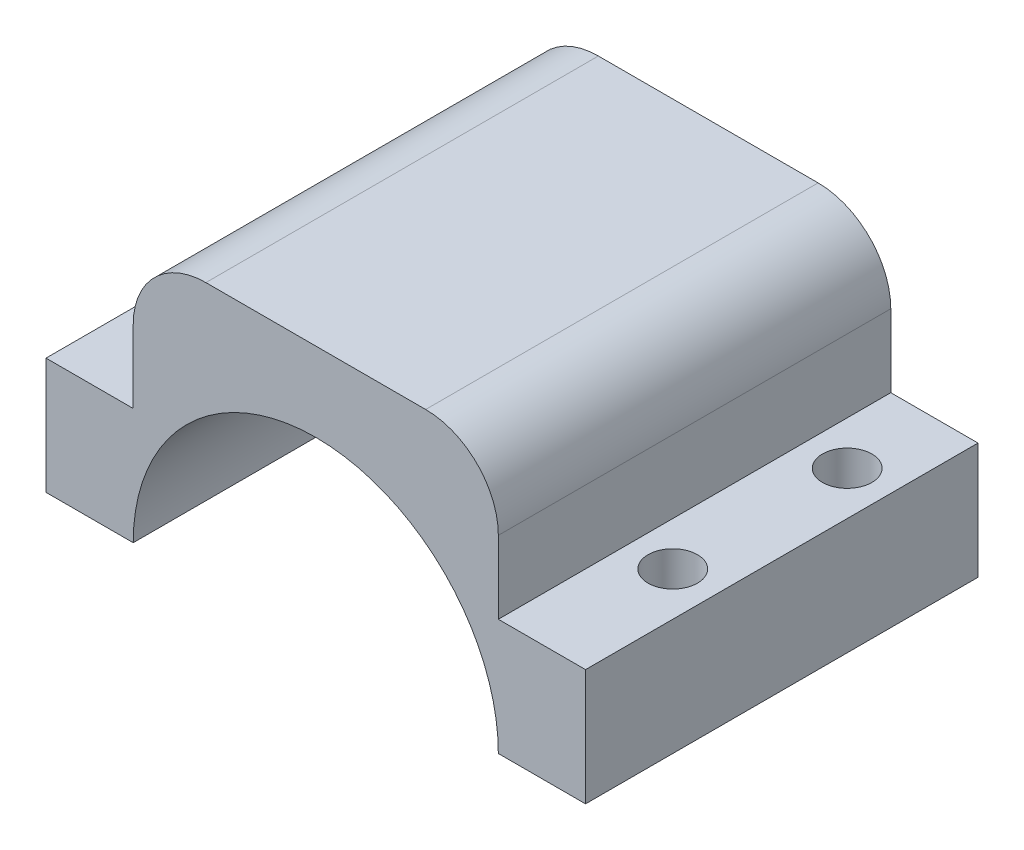
ISO-10303-21;
HEADER;
FILE_DESCRIPTION(('STEP AP214'),'2;1');
FILE_NAME('part.step','',(''),(''),'','','');
FILE_SCHEMA(('AUTOMOTIVE_DESIGN { 1 0 10303 214 1 1 1 1 }'));
ENDSEC;
DATA;
#1=APPLICATION_CONTEXT('core data for automotive mechanical design processes');
#2=APPLICATION_PROTOCOL_DEFINITION('international standard','automotive_design',2000,#1);
#3=PRODUCT_CONTEXT('',#1,'mechanical');
#4=PRODUCT('Part','Part','',(#3));
#5=PRODUCT_RELATED_PRODUCT_CATEGORY('part','',(#4));
#6=PRODUCT_DEFINITION_FORMATION('','',#4);
#7=PRODUCT_DEFINITION_CONTEXT('part definition',#1,'design');
#8=PRODUCT_DEFINITION('design','',#6,#7);
#9=PRODUCT_DEFINITION_SHAPE('','',#8);
#10=(LENGTH_UNIT() NAMED_UNIT(*) SI_UNIT(.MILLI.,.METRE.));
#11=(NAMED_UNIT(*) PLANE_ANGLE_UNIT() SI_UNIT($,.RADIAN.));
#12=(NAMED_UNIT(*) SI_UNIT($,.STERADIAN.) SOLID_ANGLE_UNIT());
#13=UNCERTAINTY_MEASURE_WITH_UNIT(LENGTH_MEASURE(1.E-05),#10,'distance_accuracy_value','');
#14=(GEOMETRIC_REPRESENTATION_CONTEXT(3) GLOBAL_UNCERTAINTY_ASSIGNED_CONTEXT((#13)) GLOBAL_UNIT_ASSIGNED_CONTEXT((#10,
#11,#12)) REPRESENTATION_CONTEXT('',''));
#15=CARTESIAN_POINT('',(0.,0.,0.));
#16=DIRECTION('',(0.,0.,1.));
#17=DIRECTION('',(1.,0.,0.));
#18=AXIS2_PLACEMENT_3D('',#15,#16,#17);
#19=CARTESIAN_POINT('',(0.,0.,27.));
#20=DIRECTION('',(0.,0.,-1.));
#21=DIRECTION('',(-1.,0.,0.));
#22=AXIS2_PLACEMENT_3D('',#19,#20,#21);
#23=CYLINDRICAL_SURFACE('',#22,12.5600623846513);
#24=CARTESIAN_POINT('',(0.,0.,0.));
#25=DIRECTION('',(0.,0.,-1.));
#26=DIRECTION('',(-1.,0.,0.));
#27=AXIS2_PLACEMENT_3D('',#24,#25,#26);
#28=CIRCLE('',#27,12.5600623846513);
#29=CARTESIAN_POINT('',(-12.5600623846513,0.,0.));
#30=VERTEX_POINT('',#29);
#31=CARTESIAN_POINT('',(12.5600623846513,0.,0.));
#32=VERTEX_POINT('',#31);
#33=EDGE_CURVE('E234',#30,#32,#28,.T.);
#34=ORIENTED_EDGE('',*,*,#33,.T.);
#35=DIRECTION('',(0.,0.,-1.));
#36=VECTOR('',#35,1.);
#37=CARTESIAN_POINT('',(12.5600623846513,0.,27.));
#38=LINE('',#37,#36);
#39=CARTESIAN_POINT('',(12.5600623846513,0.,27.));
#40=VERTEX_POINT('',#39);
#41=EDGE_CURVE('E166',#40,#32,#38,.T.);
#42=ORIENTED_EDGE('',*,*,#41,.F.);
#43=CARTESIAN_POINT('',(0.,0.,27.));
#44=DIRECTION('',(0.,0.,-1.));
#45=DIRECTION('',(-1.,0.,0.));
#46=AXIS2_PLACEMENT_3D('',#43,#44,#45);
#47=CIRCLE('',#46,12.5600623846513);
#48=CARTESIAN_POINT('',(-12.5600623846513,0.,27.));
#49=VERTEX_POINT('',#48);
#50=EDGE_CURVE('E151',#49,#40,#47,.T.);
#51=ORIENTED_EDGE('',*,*,#50,.F.);
#52=DIRECTION('',(0.,0.,-1.));
#53=VECTOR('',#52,1.);
#54=CARTESIAN_POINT('',(-12.5600623846513,0.,27.));
#55=LINE('',#54,#53);
#56=EDGE_CURVE('E157',#49,#30,#55,.T.);
#57=ORIENTED_EDGE('',*,*,#56,.T.);
#58=EDGE_LOOP('',(#34,#42,#51,#57));
#59=FACE_BOUND('',#58,.T.);
#60=ADVANCED_FACE('F33',(#59),#23,.F.);
#61=CARTESIAN_POINT('',(12.5600623846513,0.,27.));
#62=DIRECTION('',(0.,1.,0.));
#63=DIRECTION('',(-1.,0.,0.));
#64=AXIS2_PLACEMENT_3D('',#61,#62,#63);
#65=PLANE('',#64);
#66=CARTESIAN_POINT('',(15.5600623846515,0.,18.));
#67=DIRECTION('',(0.,1.,0.));
#68=DIRECTION('',(0.,0.,1.));
#69=AXIS2_PLACEMENT_3D('',#66,#67,#68);
#70=CIRCLE('',#69,1.7);
#71=CARTESIAN_POINT('',(15.5600623846515,0.,19.7));
#72=VERTEX_POINT('',#71);
#73=EDGE_CURVE('E225',#72,#72,#70,.T.);
#74=ORIENTED_EDGE('',*,*,#73,.T.);
#75=EDGE_LOOP('',(#74));
#76=FACE_BOUND('',#75,.T.);
#77=CARTESIAN_POINT('',(15.5600623846513,0.,6.));
#78=DIRECTION('',(0.,1.,0.));
#79=DIRECTION('',(0.,0.,1.));
#80=AXIS2_PLACEMENT_3D('',#77,#78,#79);
#81=CIRCLE('',#80,1.7);
#82=CARTESIAN_POINT('',(15.5600623846513,0.,7.7));
#83=VERTEX_POINT('',#82);
#84=EDGE_CURVE('E231',#83,#83,#81,.T.);
#85=ORIENTED_EDGE('',*,*,#84,.T.);
#86=EDGE_LOOP('',(#85));
#87=FACE_BOUND('',#86,.T.);
#88=DIRECTION('',(1.,0.,0.));
#89=VECTOR('',#88,1.);
#90=CARTESIAN_POINT('',(12.5600623846513,0.,0.));
#91=LINE('',#90,#89);
#92=CARTESIAN_POINT('',(18.5600623846513,0.,0.));
#93=VERTEX_POINT('',#92);
#94=EDGE_CURVE('E247',#32,#93,#91,.T.);
#95=ORIENTED_EDGE('',*,*,#94,.T.);
#96=DIRECTION('',(0.,0.,-1.));
#97=VECTOR('',#96,1.);
#98=CARTESIAN_POINT('',(18.5600623846513,0.,27.));
#99=LINE('',#98,#97);
#100=CARTESIAN_POINT('',(18.5600623846513,0.,27.));
#101=VERTEX_POINT('',#100);
#102=EDGE_CURVE('E163',#101,#93,#99,.T.);
#103=ORIENTED_EDGE('',*,*,#102,.F.);
#104=DIRECTION('',(1.,0.,0.));
#105=VECTOR('',#104,1.);
#106=CARTESIAN_POINT('',(12.5600623846513,0.,27.));
#107=LINE('',#106,#105);
#108=EDGE_CURVE('E237',#40,#101,#107,.T.);
#109=ORIENTED_EDGE('',*,*,#108,.F.);
#110=ORIENTED_EDGE('',*,*,#41,.T.);
#111=EDGE_LOOP('',(#95,#103,#109,#110));
#112=FACE_BOUND('',#111,.T.);
#113=ADVANCED_FACE('F275',(#76,#87,#112),#65,.F.);
#114=CARTESIAN_POINT('',(18.5600623846513,0.,27.));
#115=DIRECTION('',(-1.,0.,0.));
#116=DIRECTION('',(0.,0.,1.));
#117=AXIS2_PLACEMENT_3D('',#114,#115,#116);
#118=PLANE('',#117);
#119=DIRECTION('',(0.,1.,0.));
#120=VECTOR('',#119,1.);
#121=CARTESIAN_POINT('',(18.5600623846513,0.,0.));
#122=LINE('',#121,#120);
#123=CARTESIAN_POINT('',(18.5600623846513,8.,0.));
#124=VERTEX_POINT('',#123);
#125=EDGE_CURVE('E153',#93,#124,#122,.T.);
#126=ORIENTED_EDGE('',*,*,#125,.T.);
#127=DIRECTION('',(0.,0.,-1.));
#128=VECTOR('',#127,1.);
#129=CARTESIAN_POINT('',(18.5600623846513,8.,0.));
#130=LINE('',#129,#128);
#131=CARTESIAN_POINT('',(18.5600623846513,8.,27.));
#132=VERTEX_POINT('',#131);
#133=EDGE_CURVE('E254',#132,#124,#130,.T.);
#134=ORIENTED_EDGE('',*,*,#133,.F.);
#135=DIRECTION('',(0.,1.,0.));
#136=VECTOR('',#135,1.);
#137=CARTESIAN_POINT('',(18.5600623846513,0.,27.));
#138=LINE('',#137,#136);
#139=EDGE_CURVE('E239',#101,#132,#138,.T.);
#140=ORIENTED_EDGE('',*,*,#139,.F.);
#141=ORIENTED_EDGE('',*,*,#102,.T.);
#142=EDGE_LOOP('',(#126,#134,#140,#141));
#143=FACE_BOUND('',#142,.T.);
#144=ADVANCED_FACE('F252',(#143),#118,.F.);
#145=CARTESIAN_POINT('',(-18.5600623846513,18.,27.));
#146=DIRECTION('',(0.,-1.,0.));
#147=DIRECTION('',(0.,0.,-1.));
#148=AXIS2_PLACEMENT_3D('',#145,#146,#147);
#149=PLANE('',#148);
#150=DIRECTION('',(-1.,0.,0.));
#151=VECTOR('',#150,1.);
#152=CARTESIAN_POINT('',(-18.5600623846513,18.,0.));
#153=LINE('',#152,#151);
#154=CARTESIAN_POINT('',(7.56006238465134,18.,0.));
#155=VERTEX_POINT('',#154);
#156=CARTESIAN_POINT('',(-7.56006238465134,18.,0.));
#157=VERTEX_POINT('',#156);
#158=EDGE_CURVE('E149',#155,#157,#153,.T.);
#159=ORIENTED_EDGE('',*,*,#158,.T.);
#160=DIRECTION('',(0.,0.,-1.));
#161=VECTOR('',#160,1.);
#162=CARTESIAN_POINT('',(-7.56006238465135,18.,27.));
#163=LINE('',#162,#161);
#164=CARTESIAN_POINT('',(-7.56006238465135,18.,27.));
#165=VERTEX_POINT('',#164);
#166=EDGE_CURVE('E55',#157,#165,#163,.F.);
#167=ORIENTED_EDGE('',*,*,#166,.T.);
#168=DIRECTION('',(-1.,0.,0.));
#169=VECTOR('',#168,1.);
#170=CARTESIAN_POINT('',(-18.5600623846513,18.,27.));
#171=LINE('',#170,#169);
#172=CARTESIAN_POINT('',(7.56006238465135,18.,27.));
#173=VERTEX_POINT('',#172);
#174=EDGE_CURVE('E195',#173,#165,#171,.T.);
#175=ORIENTED_EDGE('',*,*,#174,.F.);
#176=DIRECTION('',(0.,0.,1.));
#177=VECTOR('',#176,1.);
#178=CARTESIAN_POINT('',(7.56006238465135,18.,27.));
#179=LINE('',#178,#177);
#180=EDGE_CURVE('E186',#173,#155,#179,.F.);
#181=ORIENTED_EDGE('',*,*,#180,.T.);
#182=EDGE_LOOP('',(#159,#167,#175,#181));
#183=FACE_BOUND('',#182,.T.);
#184=ADVANCED_FACE('F204',(#183),#149,.F.);
#185=CARTESIAN_POINT('',(-18.5600623846513,0.,27.));
#186=DIRECTION('',(1.,0.,0.));
#187=DIRECTION('',(0.,0.,-1.));
#188=AXIS2_PLACEMENT_3D('',#185,#186,#187);
#189=PLANE('',#188);
#190=DIRECTION('',(0.,-1.,0.));
#191=VECTOR('',#190,1.);
#192=CARTESIAN_POINT('',(-18.5600623846513,0.,27.));
#193=LINE('',#192,#191);
#194=CARTESIAN_POINT('',(-18.5600623846513,8.,27.));
#195=VERTEX_POINT('',#194);
#196=CARTESIAN_POINT('',(-18.5600623846513,0.,27.));
#197=VERTEX_POINT('',#196);
#198=EDGE_CURVE('E142',#195,#197,#193,.T.);
#199=ORIENTED_EDGE('',*,*,#198,.F.);
#200=DIRECTION('',(0.,0.,1.));
#201=VECTOR('',#200,1.);
#202=CARTESIAN_POINT('',(-18.5600623846513,8.,0.));
#203=LINE('',#202,#201);
#204=CARTESIAN_POINT('',(-18.5600623846513,8.,0.));
#205=VERTEX_POINT('',#204);
#206=EDGE_CURVE('E127',#205,#195,#203,.T.);
#207=ORIENTED_EDGE('',*,*,#206,.F.);
#208=DIRECTION('',(0.,-1.,0.));
#209=VECTOR('',#208,1.);
#210=CARTESIAN_POINT('',(-18.5600623846513,0.,0.));
#211=LINE('',#210,#209);
#212=CARTESIAN_POINT('',(-18.5600623846513,0.,0.));
#213=VERTEX_POINT('',#212);
#214=EDGE_CURVE('E140',#205,#213,#211,.T.);
#215=ORIENTED_EDGE('',*,*,#214,.T.);
#216=DIRECTION('',(0.,0.,-1.));
#217=VECTOR('',#216,1.);
#218=CARTESIAN_POINT('',(-18.5600623846513,0.,27.));
#219=LINE('',#218,#217);
#220=EDGE_CURVE('E160',#197,#213,#219,.T.);
#221=ORIENTED_EDGE('',*,*,#220,.F.);
#222=EDGE_LOOP('',(#199,#207,#215,#221));
#223=FACE_BOUND('',#222,.T.);
#224=ADVANCED_FACE('F138',(#223),#189,.F.);
#225=CARTESIAN_POINT('',(-12.5600623846513,0.,27.));
#226=DIRECTION('',(0.,1.,0.));
#227=DIRECTION('',(-1.,0.,0.));
#228=AXIS2_PLACEMENT_3D('',#225,#226,#227);
#229=PLANE('',#228);
#230=CARTESIAN_POINT('',(-15.5600623846512,0.,18.));
#231=DIRECTION('',(0.,1.,0.));
#232=DIRECTION('',(0.,0.,-1.));
#233=AXIS2_PLACEMENT_3D('',#230,#231,#232);
#234=CIRCLE('',#233,1.7);
#235=CARTESIAN_POINT('',(-15.5600623846512,0.,16.3));
#236=VERTEX_POINT('',#235);
#237=EDGE_CURVE('E222',#236,#236,#234,.T.);
#238=ORIENTED_EDGE('',*,*,#237,.T.);
#239=EDGE_LOOP('',(#238));
#240=FACE_BOUND('',#239,.T.);
#241=CARTESIAN_POINT('',(-15.5600623846513,0.,6.));
#242=DIRECTION('',(0.,1.,0.));
#243=DIRECTION('',(0.,0.,-1.));
#244=AXIS2_PLACEMENT_3D('',#241,#242,#243);
#245=CIRCLE('',#244,1.7);
#246=CARTESIAN_POINT('',(-15.5600623846513,0.,4.3));
#247=VERTEX_POINT('',#246);
#248=EDGE_CURVE('E228',#247,#247,#245,.T.);
#249=ORIENTED_EDGE('',*,*,#248,.T.);
#250=EDGE_LOOP('',(#249));
#251=FACE_BOUND('',#250,.T.);
#252=DIRECTION('',(1.,0.,0.));
#253=VECTOR('',#252,1.);
#254=CARTESIAN_POINT('',(-12.5600623846513,0.,0.));
#255=LINE('',#254,#253);
#256=EDGE_CURVE('E148',#213,#30,#255,.T.);
#257=ORIENTED_EDGE('',*,*,#256,.T.);
#258=ORIENTED_EDGE('',*,*,#56,.F.);
#259=DIRECTION('',(1.,0.,0.));
#260=VECTOR('',#259,1.);
#261=CARTESIAN_POINT('',(-12.5600623846513,0.,27.));
#262=LINE('',#261,#260);
#263=EDGE_CURVE('E161',#197,#49,#262,.T.);
#264=ORIENTED_EDGE('',*,*,#263,.F.);
#265=ORIENTED_EDGE('',*,*,#220,.T.);
#266=EDGE_LOOP('',(#257,#258,#264,#265));
#267=FACE_BOUND('',#266,.T.);
#268=ADVANCED_FACE('F269',(#240,#251,#267),#229,.F.);
#269=CARTESIAN_POINT('',(0.,0.,27.));
#270=DIRECTION('',(0.,0.,-1.));
#271=DIRECTION('',(-1.,0.,0.));
#272=AXIS2_PLACEMENT_3D('',#269,#270,#271);
#273=PLANE('',#272);
#274=ORIENTED_EDGE('',*,*,#174,.T.);
#275=CARTESIAN_POINT('',(-7.56006238465135,13.,27.));
#276=DIRECTION('',(0.,0.,-1.));
#277=DIRECTION('',(-1.,0.,0.));
#278=AXIS2_PLACEMENT_3D('',#275,#276,#277);
#279=CIRCLE('',#278,5.);
#280=CARTESIAN_POINT('',(-12.5600623846513,13.,27.));
#281=VERTEX_POINT('',#280);
#282=EDGE_CURVE('E41',#165,#281,#279,.F.);
#283=ORIENTED_EDGE('',*,*,#282,.T.);
#284=DIRECTION('',(0.,1.,0.));
#285=VECTOR('',#284,1.);
#286=CARTESIAN_POINT('',(-12.5600623846513,8.,27.));
#287=LINE('',#286,#285);
#288=CARTESIAN_POINT('',(-12.5600623846513,8.,27.));
#289=VERTEX_POINT('',#288);
#290=EDGE_CURVE('E194',#289,#281,#287,.T.);
#291=ORIENTED_EDGE('',*,*,#290,.F.);
#292=DIRECTION('',(1.,0.,0.));
#293=VECTOR('',#292,1.);
#294=CARTESIAN_POINT('',(-18.5600623846513,8.,27.));
#295=LINE('',#294,#293);
#296=EDGE_CURVE('E143',#195,#289,#295,.T.);
#297=ORIENTED_EDGE('',*,*,#296,.F.);
#298=ORIENTED_EDGE('',*,*,#198,.T.);
#299=ORIENTED_EDGE('',*,*,#263,.T.);
#300=ORIENTED_EDGE('',*,*,#50,.T.);
#301=ORIENTED_EDGE('',*,*,#108,.T.);
#302=ORIENTED_EDGE('',*,*,#139,.T.);
#303=DIRECTION('',(1.,0.,0.));
#304=VECTOR('',#303,1.);
#305=CARTESIAN_POINT('',(18.5600623846513,8.,27.));
#306=LINE('',#305,#304);
#307=CARTESIAN_POINT('',(12.5600623846513,8.,27.));
#308=VERTEX_POINT('',#307);
#309=EDGE_CURVE('E215',#308,#132,#306,.T.);
#310=ORIENTED_EDGE('',*,*,#309,.F.);
#311=DIRECTION('',(0.,1.,0.));
#312=VECTOR('',#311,1.);
#313=CARTESIAN_POINT('',(12.5600623846513,8.,27.));
#314=LINE('',#313,#312);
#315=CARTESIAN_POINT('',(12.5600623846513,13.,27.));
#316=VERTEX_POINT('',#315);
#317=EDGE_CURVE('E174',#308,#316,#314,.T.);
#318=ORIENTED_EDGE('',*,*,#317,.T.);
#319=CARTESIAN_POINT('',(7.56006238465135,13.,27.));
#320=DIRECTION('',(0.,0.,-1.));
#321=DIRECTION('',(-1.,0.,0.));
#322=AXIS2_PLACEMENT_3D('',#319,#320,#321);
#323=CIRCLE('',#322,5.);
#324=EDGE_CURVE('E48',#316,#173,#323,.F.);
#325=ORIENTED_EDGE('',*,*,#324,.T.);
#326=EDGE_LOOP('',(#274,#283,#291,#297,#298,#299,#300,#301,#302,#310,#318,#325));
#327=FACE_BOUND('',#326,.T.);
#328=ADVANCED_FACE('F193',(#327),#273,.F.);
#329=CARTESIAN_POINT('',(0.,0.,0.));
#330=DIRECTION('',(0.,0.,-1.));
#331=DIRECTION('',(-1.,0.,0.));
#332=AXIS2_PLACEMENT_3D('',#329,#330,#331);
#333=PLANE('',#332);
#334=DIRECTION('',(0.,1.,0.));
#335=VECTOR('',#334,1.);
#336=CARTESIAN_POINT('',(-12.5600623846513,8.,0.));
#337=LINE('',#336,#335);
#338=CARTESIAN_POINT('',(-12.5600623846513,8.,0.));
#339=VERTEX_POINT('',#338);
#340=CARTESIAN_POINT('',(-12.5600623846513,13.,0.));
#341=VERTEX_POINT('',#340);
#342=EDGE_CURVE('E179',#339,#341,#337,.T.);
#343=ORIENTED_EDGE('',*,*,#342,.T.);
#344=CARTESIAN_POINT('',(-7.56006238465134,13.,0.));
#345=DIRECTION('',(0.,0.,-1.));
#346=DIRECTION('',(-1.,0.,0.));
#347=AXIS2_PLACEMENT_3D('',#344,#345,#346);
#348=CIRCLE('',#347,5.);
#349=EDGE_CURVE('E184',#341,#157,#348,.T.);
#350=ORIENTED_EDGE('',*,*,#349,.T.);
#351=ORIENTED_EDGE('',*,*,#158,.F.);
#352=CARTESIAN_POINT('',(7.56006238465134,13.,0.));
#353=DIRECTION('',(0.,0.,-1.));
#354=DIRECTION('',(-1.,0.,0.));
#355=AXIS2_PLACEMENT_3D('',#352,#353,#354);
#356=CIRCLE('',#355,5.);
#357=CARTESIAN_POINT('',(12.5600623846513,13.,0.));
#358=VERTEX_POINT('',#357);
#359=EDGE_CURVE('E182',#155,#358,#356,.T.);
#360=ORIENTED_EDGE('',*,*,#359,.T.);
#361=DIRECTION('',(0.,1.,0.));
#362=VECTOR('',#361,1.);
#363=CARTESIAN_POINT('',(12.5600623846513,8.,0.));
#364=LINE('',#363,#362);
#365=CARTESIAN_POINT('',(12.5600623846513,8.,0.));
#366=VERTEX_POINT('',#365);
#367=EDGE_CURVE('E208',#366,#358,#364,.T.);
#368=ORIENTED_EDGE('',*,*,#367,.F.);
#369=DIRECTION('',(-1.,0.,0.));
#370=VECTOR('',#369,1.);
#371=CARTESIAN_POINT('',(18.5600623846513,8.,0.));
#372=LINE('',#371,#370);
#373=EDGE_CURVE('E256',#124,#366,#372,.T.);
#374=ORIENTED_EDGE('',*,*,#373,.F.);
#375=ORIENTED_EDGE('',*,*,#125,.F.);
#376=ORIENTED_EDGE('',*,*,#94,.F.);
#377=ORIENTED_EDGE('',*,*,#33,.F.);
#378=ORIENTED_EDGE('',*,*,#256,.F.);
#379=ORIENTED_EDGE('',*,*,#214,.F.);
#380=DIRECTION('',(-1.,0.,0.));
#381=VECTOR('',#380,1.);
#382=CARTESIAN_POINT('',(-18.5600623846513,8.,0.));
#383=LINE('',#382,#381);
#384=EDGE_CURVE('E123',#339,#205,#383,.T.);
#385=ORIENTED_EDGE('',*,*,#384,.F.);
#386=EDGE_LOOP('',(#343,#350,#351,#360,#368,#374,#375,#376,#377,#378,#379,#385));
#387=FACE_BOUND('',#386,.T.);
#388=ADVANCED_FACE('F146',(#387),#333,.T.);
#389=CARTESIAN_POINT('',(15.5600623846513,0.,6.));
#390=DIRECTION('',(0.,1.,0.));
#391=DIRECTION('',(0.,0.,1.));
#392=AXIS2_PLACEMENT_3D('',#389,#390,#391);
#393=CYLINDRICAL_SURFACE('',#392,1.7);
#394=CARTESIAN_POINT('',(15.5600623846513,8.,6.));
#395=DIRECTION('',(0.,-1.,0.));
#396=DIRECTION('',(0.,0.,-1.));
#397=AXIS2_PLACEMENT_3D('',#394,#395,#396);
#398=CIRCLE('',#397,1.7);
#399=CARTESIAN_POINT('',(15.5600623846513,8.,4.3));
#400=VERTEX_POINT('',#399);
#401=EDGE_CURVE('E173',#400,#400,#398,.F.);
#402=ORIENTED_EDGE('',*,*,#401,.T.);
#403=EDGE_LOOP('',(#402));
#404=FACE_BOUND('',#403,.T.);
#405=ORIENTED_EDGE('',*,*,#84,.F.);
#406=EDGE_LOOP('',(#405));
#407=FACE_BOUND('',#406,.T.);
#408=ADVANCED_FACE('F316',(#404,#407),#393,.F.);
#409=CARTESIAN_POINT('',(-15.5600623846513,0.,6.));
#410=DIRECTION('',(0.,1.,0.));
#411=DIRECTION('',(0.,0.,1.));
#412=AXIS2_PLACEMENT_3D('',#409,#410,#411);
#413=CYLINDRICAL_SURFACE('',#412,1.7);
#414=CARTESIAN_POINT('',(-15.5600623846513,8.,6.));
#415=DIRECTION('',(0.,-1.,0.));
#416=DIRECTION('',(0.,0.,-1.));
#417=AXIS2_PLACEMENT_3D('',#414,#415,#416);
#418=CIRCLE('',#417,1.7);
#419=CARTESIAN_POINT('',(-15.5600623846513,8.,4.3));
#420=VERTEX_POINT('',#419);
#421=EDGE_CURVE('E178',#420,#420,#418,.F.);
#422=ORIENTED_EDGE('',*,*,#421,.T.);
#423=EDGE_LOOP('',(#422));
#424=FACE_BOUND('',#423,.T.);
#425=ORIENTED_EDGE('',*,*,#248,.F.);
#426=EDGE_LOOP('',(#425));
#427=FACE_BOUND('',#426,.T.);
#428=ADVANCED_FACE('F312',(#424,#427),#413,.F.);
#429=CARTESIAN_POINT('',(15.5600623846515,0.,18.));
#430=DIRECTION('',(0.,1.,0.));
#431=DIRECTION('',(0.,0.,1.));
#432=AXIS2_PLACEMENT_3D('',#429,#430,#431);
#433=CYLINDRICAL_SURFACE('',#432,1.7);
#434=CARTESIAN_POINT('',(15.5600623846515,8.,18.));
#435=DIRECTION('',(0.,-1.,0.));
#436=DIRECTION('',(0.,0.,-1.));
#437=AXIS2_PLACEMENT_3D('',#434,#435,#436);
#438=CIRCLE('',#437,1.7);
#439=CARTESIAN_POINT('',(15.5600623846515,8.,16.3));
#440=VERTEX_POINT('',#439);
#441=EDGE_CURVE('E170',#440,#440,#438,.F.);
#442=ORIENTED_EDGE('',*,*,#441,.T.);
#443=EDGE_LOOP('',(#442));
#444=FACE_BOUND('',#443,.T.);
#445=ORIENTED_EDGE('',*,*,#73,.F.);
#446=EDGE_LOOP('',(#445));
#447=FACE_BOUND('',#446,.T.);
#448=ADVANCED_FACE('F308',(#444,#447),#433,.F.);
#449=CARTESIAN_POINT('',(-15.5600623846512,0.,18.));
#450=DIRECTION('',(0.,1.,0.));
#451=DIRECTION('',(0.,0.,1.));
#452=AXIS2_PLACEMENT_3D('',#449,#450,#451);
#453=CYLINDRICAL_SURFACE('',#452,1.7);
#454=CARTESIAN_POINT('',(-15.5600623846512,8.,18.));
#455=DIRECTION('',(0.,-1.,0.));
#456=DIRECTION('',(0.,0.,-1.));
#457=AXIS2_PLACEMENT_3D('',#454,#455,#456);
#458=CIRCLE('',#457,1.7);
#459=CARTESIAN_POINT('',(-15.5600623846512,8.,16.3));
#460=VERTEX_POINT('',#459);
#461=EDGE_CURVE('E175',#460,#460,#458,.F.);
#462=ORIENTED_EDGE('',*,*,#461,.T.);
#463=EDGE_LOOP('',(#462));
#464=FACE_BOUND('',#463,.T.);
#465=ORIENTED_EDGE('',*,*,#237,.F.);
#466=EDGE_LOOP('',(#465));
#467=FACE_BOUND('',#466,.T.);
#468=ADVANCED_FACE('F302',(#464,#467),#453,.F.);
#469=CARTESIAN_POINT('',(0.,8.,0.));
#470=DIRECTION('',(0.,-1.,0.));
#471=DIRECTION('',(0.,0.,-1.));
#472=AXIS2_PLACEMENT_3D('',#469,#470,#471);
#473=PLANE('',#472);
#474=ORIENTED_EDGE('',*,*,#441,.F.);
#475=EDGE_LOOP('',(#474));
#476=FACE_BOUND('',#475,.T.);
#477=ORIENTED_EDGE('',*,*,#133,.T.);
#478=ORIENTED_EDGE('',*,*,#373,.T.);
#479=DIRECTION('',(0.,0.,1.));
#480=VECTOR('',#479,1.);
#481=CARTESIAN_POINT('',(12.5600623846513,8.,0.));
#482=LINE('',#481,#480);
#483=EDGE_CURVE('E213',#366,#308,#482,.T.);
#484=ORIENTED_EDGE('',*,*,#483,.T.);
#485=ORIENTED_EDGE('',*,*,#309,.T.);
#486=EDGE_LOOP('',(#477,#478,#484,#485));
#487=FACE_BOUND('',#486,.T.);
#488=ORIENTED_EDGE('',*,*,#401,.F.);
#489=EDGE_LOOP('',(#488));
#490=FACE_BOUND('',#489,.T.);
#491=ADVANCED_FACE('F299',(#476,#487,#490),#473,.F.);
#492=CARTESIAN_POINT('',(12.5600623846513,8.,0.));
#493=DIRECTION('',(-1.,0.,0.));
#494=DIRECTION('',(0.,0.,1.));
#495=AXIS2_PLACEMENT_3D('',#492,#493,#494);
#496=PLANE('',#495);
#497=ORIENTED_EDGE('',*,*,#367,.T.);
#498=DIRECTION('',(0.,0.,1.));
#499=VECTOR('',#498,1.);
#500=CARTESIAN_POINT('',(12.5600623846513,13.,0.));
#501=LINE('',#500,#499);
#502=EDGE_CURVE('E11',#358,#316,#501,.T.);
#503=ORIENTED_EDGE('',*,*,#502,.T.);
#504=ORIENTED_EDGE('',*,*,#317,.F.);
#505=ORIENTED_EDGE('',*,*,#483,.F.);
#506=EDGE_LOOP('',(#497,#503,#504,#505));
#507=FACE_BOUND('',#506,.T.);
#508=ADVANCED_FACE('F210',(#507),#496,.F.);
#509=CARTESIAN_POINT('',(0.,8.,0.));
#510=DIRECTION('',(0.,-1.,0.));
#511=DIRECTION('',(0.,0.,-1.));
#512=AXIS2_PLACEMENT_3D('',#509,#510,#511);
#513=PLANE('',#512);
#514=ORIENTED_EDGE('',*,*,#461,.F.);
#515=EDGE_LOOP('',(#514));
#516=FACE_BOUND('',#515,.T.);
#517=ORIENTED_EDGE('',*,*,#384,.T.);
#518=ORIENTED_EDGE('',*,*,#206,.T.);
#519=ORIENTED_EDGE('',*,*,#296,.T.);
#520=DIRECTION('',(0.,0.,-1.));
#521=VECTOR('',#520,1.);
#522=CARTESIAN_POINT('',(-12.5600623846513,8.,0.));
#523=LINE('',#522,#521);
#524=EDGE_CURVE('E130',#289,#339,#523,.T.);
#525=ORIENTED_EDGE('',*,*,#524,.T.);
#526=EDGE_LOOP('',(#517,#518,#519,#525));
#527=FACE_BOUND('',#526,.T.);
#528=ORIENTED_EDGE('',*,*,#421,.F.);
#529=EDGE_LOOP('',(#528));
#530=FACE_BOUND('',#529,.T.);
#531=ADVANCED_FACE('F125',(#516,#527,#530),#513,.F.);
#532=CARTESIAN_POINT('',(-12.5600623846513,8.,0.));
#533=DIRECTION('',(1.,0.,0.));
#534=DIRECTION('',(0.,0.,-1.));
#535=AXIS2_PLACEMENT_3D('',#532,#533,#534);
#536=PLANE('',#535);
#537=ORIENTED_EDGE('',*,*,#290,.T.);
#538=DIRECTION('',(0.,0.,-1.));
#539=VECTOR('',#538,1.);
#540=CARTESIAN_POINT('',(-12.5600623846513,13.,0.));
#541=LINE('',#540,#539);
#542=EDGE_CURVE('E169',#281,#341,#541,.T.);
#543=ORIENTED_EDGE('',*,*,#542,.T.);
#544=ORIENTED_EDGE('',*,*,#342,.F.);
#545=ORIENTED_EDGE('',*,*,#524,.F.);
#546=EDGE_LOOP('',(#537,#543,#544,#545));
#547=FACE_BOUND('',#546,.T.);
#548=ADVANCED_FACE('F199',(#547),#536,.F.);
#549=CARTESIAN_POINT('',(-7.56006238465134,13.,0.));
#550=DIRECTION('',(0.,0.,-1.));
#551=DIRECTION('',(-1.,0.,0.));
#552=AXIS2_PLACEMENT_3D('',#549,#550,#551);
#553=CYLINDRICAL_SURFACE('',#552,5.);
#554=ORIENTED_EDGE('',*,*,#282,.F.);
#555=ORIENTED_EDGE('',*,*,#166,.F.);
#556=ORIENTED_EDGE('',*,*,#349,.F.);
#557=ORIENTED_EDGE('',*,*,#542,.F.);
#558=EDGE_LOOP('',(#554,#555,#556,#557));
#559=FACE_BOUND('',#558,.T.);
#560=ADVANCED_FACE('F201',(#559),#553,.T.);
#561=CARTESIAN_POINT('',(7.56006238465134,13.,0.));
#562=DIRECTION('',(0.,0.,1.));
#563=DIRECTION('',(1.,0.,0.));
#564=AXIS2_PLACEMENT_3D('',#561,#562,#563);
#565=CYLINDRICAL_SURFACE('',#564,5.);
#566=ORIENTED_EDGE('',*,*,#359,.F.);
#567=ORIENTED_EDGE('',*,*,#180,.F.);
#568=ORIENTED_EDGE('',*,*,#324,.F.);
#569=ORIENTED_EDGE('',*,*,#502,.F.);
#570=EDGE_LOOP('',(#566,#567,#568,#569));
#571=FACE_BOUND('',#570,.T.);
#572=ADVANCED_FACE('F35',(#571),#565,.T.);
#573=CLOSED_SHELL('',(#60,#113,#144,#184,#224,#268,#328,#388,#408,#428,#448,#468,#491,#508,#531,
#548,#560,#572));
#574=MANIFOLD_SOLID_BREP('B2',#573);
#575=ADVANCED_BREP_SHAPE_REPRESENTATION('',(#18,#574),#14);
#576=SHAPE_DEFINITION_REPRESENTATION(#9,#575);
ENDSEC;
END-ISO-10303-21;
